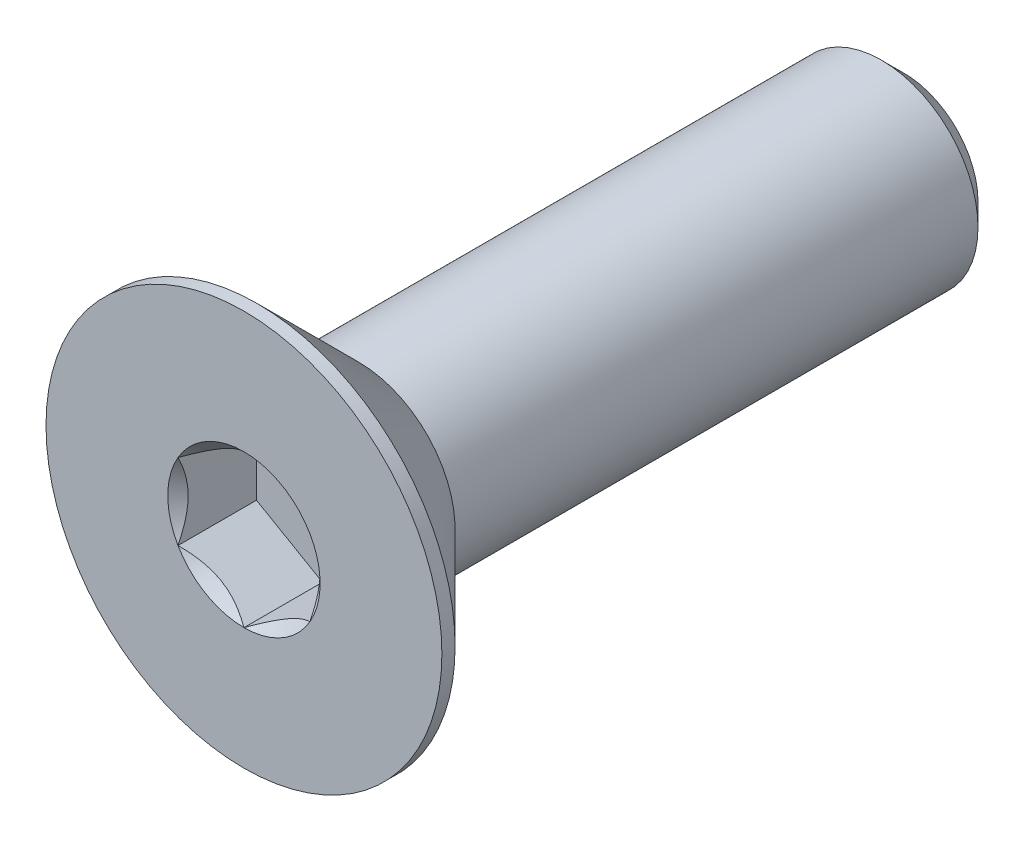
ISO-10303-21;
HEADER;
FILE_DESCRIPTION(('STEP AP214'),'2;1');
FILE_NAME('part.step','',(''),(''),'','','');
FILE_SCHEMA(('AUTOMOTIVE_DESIGN { 1 0 10303 214 1 1 1 1 }'));
ENDSEC;
DATA;
#1=APPLICATION_CONTEXT('core data for automotive mechanical design processes');
#2=APPLICATION_PROTOCOL_DEFINITION('international standard','automotive_design',2000,#1);
#3=PRODUCT_CONTEXT('',#1,'mechanical');
#4=PRODUCT('Part','Part','',(#3));
#5=PRODUCT_RELATED_PRODUCT_CATEGORY('part','',(#4));
#6=PRODUCT_DEFINITION_FORMATION('','',#4);
#7=PRODUCT_DEFINITION_CONTEXT('part definition',#1,'design');
#8=PRODUCT_DEFINITION('design','',#6,#7);
#9=PRODUCT_DEFINITION_SHAPE('','',#8);
#10=(LENGTH_UNIT() NAMED_UNIT(*) SI_UNIT(.MILLI.,.METRE.));
#11=(NAMED_UNIT(*) PLANE_ANGLE_UNIT() SI_UNIT($,.RADIAN.));
#12=(NAMED_UNIT(*) SI_UNIT($,.STERADIAN.) SOLID_ANGLE_UNIT());
#13=UNCERTAINTY_MEASURE_WITH_UNIT(LENGTH_MEASURE(1.E-05),#10,'distance_accuracy_value','');
#14=(GEOMETRIC_REPRESENTATION_CONTEXT(3) GLOBAL_UNCERTAINTY_ASSIGNED_CONTEXT((#13)) GLOBAL_UNIT_ASSIGNED_CONTEXT((#10,
#11,#12)) REPRESENTATION_CONTEXT('',''));
#15=CARTESIAN_POINT('',(0.,0.,0.));
#16=DIRECTION('',(0.,0.,1.));
#17=DIRECTION('',(1.,0.,0.));
#18=AXIS2_PLACEMENT_3D('',#15,#16,#17);
#19=CARTESIAN_POINT('',(1.,-0.577350269189626,-1.19));
#20=DIRECTION('',(0.,0.,1.));
#21=DIRECTION('',(1.,0.,0.));
#22=AXIS2_PLACEMENT_3D('',#19,#20,#21);
#23=PLANE('',#22);
#24=DIRECTION('',(0.,1.,0.));
#25=VECTOR('',#24,1.);
#26=CARTESIAN_POINT('',(-1.,0.577350269189626,-1.19));
#27=LINE('',#26,#25);
#28=CARTESIAN_POINT('',(-1.,0.577350269189627,-1.19));
#29=VERTEX_POINT('',#28);
#30=CARTESIAN_POINT('',(-1.,-0.577350269189626,-1.19));
#31=VERTEX_POINT('',#30);
#32=EDGE_CURVE('E83',#29,#31,#27,.F.);
#33=ORIENTED_EDGE('',*,*,#32,.T.);
#34=DIRECTION('',(0.866025403784439,-0.5,0.));
#35=VECTOR('',#34,1.);
#36=CARTESIAN_POINT('',(-1.,-0.577350269189626,-1.19));
#37=LINE('',#36,#35);
#38=CARTESIAN_POINT('',(0.,-1.15470053837925,-1.19));
#39=VERTEX_POINT('',#38);
#40=EDGE_CURVE('E85',#31,#39,#37,.T.);
#41=ORIENTED_EDGE('',*,*,#40,.T.);
#42=DIRECTION('',(0.866025403784439,0.5,0.));
#43=VECTOR('',#42,1.);
#44=CARTESIAN_POINT('',(0.,-1.15470053837925,-1.19));
#45=LINE('',#44,#43);
#46=CARTESIAN_POINT('',(1.,-0.577350269189626,-1.19));
#47=VERTEX_POINT('',#46);
#48=EDGE_CURVE('E86',#39,#47,#45,.T.);
#49=ORIENTED_EDGE('',*,*,#48,.T.);
#50=DIRECTION('',(0.,1.,0.));
#51=VECTOR('',#50,1.);
#52=CARTESIAN_POINT('',(1.,-0.577350269189626,-1.19));
#53=LINE('',#52,#51);
#54=CARTESIAN_POINT('',(1.,0.577350269189626,-1.19));
#55=VERTEX_POINT('',#54);
#56=EDGE_CURVE('E72',#47,#55,#53,.T.);
#57=ORIENTED_EDGE('',*,*,#56,.T.);
#58=DIRECTION('',(-0.866025403784439,0.5,0.));
#59=VECTOR('',#58,1.);
#60=CARTESIAN_POINT('',(1.,0.577350269189626,-1.19));
#61=LINE('',#60,#59);
#62=CARTESIAN_POINT('',(0.,1.15470053837925,-1.19));
#63=VERTEX_POINT('',#62);
#64=EDGE_CURVE('E111',#55,#63,#61,.T.);
#65=ORIENTED_EDGE('',*,*,#64,.T.);
#66=DIRECTION('',(-0.866025403784439,-0.5,0.));
#67=VECTOR('',#66,1.);
#68=CARTESIAN_POINT('',(0.,1.15470053837925,-1.19));
#69=LINE('',#68,#67);
#70=EDGE_CURVE('E116',#63,#29,#69,.T.);
#71=ORIENTED_EDGE('',*,*,#70,.T.);
#72=EDGE_LOOP('',(#33,#41,#49,#57,#65,#71));
#73=FACE_BOUND('',#72,.T.);
#74=ADVANCED_FACE('F17',(#73),#23,.T.);
#75=CARTESIAN_POINT('',(0.,-1.15470053837925,-1.19));
#76=DIRECTION('',(0.5,-0.866025403784439,0.));
#77=DIRECTION('',(0.866025403784439,0.5,0.));
#78=AXIS2_PLACEMENT_3D('',#75,#76,#77);
#79=PLANE('',#78);
#80=CARTESIAN_POINT('',(-2.49115863796558E-11,-1.15470053838384,-5.41781004328016E-11));
#81=CARTESIAN_POINT('',(0.0343705355318739,-1.13485670043421,-0.0198247003728132));
#82=CARTESIAN_POINT('',(0.0693156756624321,-1.11468111437554,-0.0384849664360592));
#83=CARTESIAN_POINT('',(0.140572403044767,-1.07354102364168,-0.0726511231876599));
#84=CARTESIAN_POINT('',(0.176890763115106,-1.05257260867784,-0.0881380100890203));
#85=CARTESIAN_POINT('',(0.250125097705039,-1.01029074588792,-0.114666959730657));
#86=CARTESIAN_POINT('',(0.287022429466985,-0.988988061462962,-0.12577568751602));
#87=CARTESIAN_POINT('',(0.361628600507243,-0.945914168529794,-0.142891513177912));
#88=CARTESIAN_POINT('',(0.399335163709025,-0.924144274114979,-0.14891138024967));
#89=CARTESIAN_POINT('',(0.464327716051176,-0.886620806524892,-0.154341115333756));
#90=CARTESIAN_POINT('',(0.491529304817382,-0.870915961928344,-0.155143433160573));
#91=CARTESIAN_POINT('',(0.545879708718377,-0.839536741605546,-0.153791220342047));
#92=CARTESIAN_POINT('',(0.573028510869161,-0.823862373375613,-0.151636036537232));
#93=CARTESIAN_POINT('',(0.654087027901815,-0.777063216746695,-0.14087668039145));
#94=CARTESIAN_POINT('',(0.707593237355406,-0.74617139231535,-0.127977491880707));
#95=CARTESIAN_POINT('',(0.801462739360661,-0.691975810063921,-0.0968623194753811));
#96=CARTESIAN_POINT('',(0.842267871073143,-0.668416956285401,-0.0802830123447291));
#97=CARTESIAN_POINT('',(0.922281198805544,-0.622221239980341,-0.042938715097711));
#98=CARTESIAN_POINT('',(0.961494106300555,-0.599581657282388,-0.0221873504181556));
#99=CARTESIAN_POINT('',(1.00000000002168,-0.577350269177109,-5.82450399194179E-11));
#100=B_SPLINE_CURVE_WITH_KNOTS('',3,(#80,#81,#82,#83,#84,#85,#86,#87,#88,#89,#90,#91,#92,#93,
#94,#95,#96,#97,#98,#99),.UNSPECIFIED.,.F.,.F.,(4,2,2,2,2,2,2,2,2,4),(0.,0.13318294658579,
0.267141541476444,0.398973326829551,0.53047332372228,0.624596460467739,0.718740387502035,
0.90708160060652,1.05673041333679,1.20589820629177),.UNSPECIFIED.);
#101=CARTESIAN_POINT('',(0.,-1.15470053839212,-5.7899518341867E-11));
#102=VERTEX_POINT('',#101);
#103=CARTESIAN_POINT('',(1.00000000001114,-0.577350269197114,-5.73712353374379E-11));
#104=VERTEX_POINT('',#103);
#105=EDGE_CURVE('E20',#102,#104,#100,.T.);
#106=ORIENTED_EDGE('',*,*,#105,.T.);
#107=DIRECTION('',(0.,0.,-1.));
#108=VECTOR('',#107,1.);
#109=CARTESIAN_POINT('',(1.,-0.577350269189626,-1.19));
#110=LINE('',#109,#108);
#111=EDGE_CURVE('E91',#104,#47,#110,.T.);
#112=ORIENTED_EDGE('',*,*,#111,.T.);
#113=ORIENTED_EDGE('',*,*,#48,.F.);
#114=DIRECTION('',(0.,0.,1.));
#115=VECTOR('',#114,1.);
#116=CARTESIAN_POINT('',(0.,-1.15470053837925,-1.19));
#117=LINE('',#116,#115);
#118=EDGE_CURVE('E59',#39,#102,#117,.T.);
#119=ORIENTED_EDGE('',*,*,#118,.T.);
#120=EDGE_LOOP('',(#106,#112,#113,#119));
#121=FACE_BOUND('',#120,.T.);
#122=ADVANCED_FACE('F90',(#121),#79,.F.);
#123=CARTESIAN_POINT('',(-1.,-0.577350269189626,-1.19));
#124=DIRECTION('',(-0.5,-0.866025403784439,0.));
#125=DIRECTION('',(0.866025403784439,-0.5,0.));
#126=AXIS2_PLACEMENT_3D('',#123,#124,#125);
#127=PLANE('',#126);
#128=CARTESIAN_POINT('',(-1.00000000001643,-0.577350269170344,-5.41781098430251E-11));
#129=CARTESIAN_POINT('',(-0.965629464465074,-0.597194107129382,-0.0198247003728132));
#130=CARTESIAN_POINT('',(-0.930684324336749,-0.617369693191919,-0.0384849664360593));
#131=CARTESIAN_POINT('',(-0.859427596956058,-0.658509783928631,-0.0726511231876602));
#132=CARTESIAN_POINT('',(-0.823109236885113,-0.679478198891418,-0.0881380100890208));
#133=CARTESIAN_POINT('',(-0.749874902294746,-0.721760061680587,-0.114666959730657));
#134=CARTESIAN_POINT('',(-0.712977570532958,-0.743062746105818,-0.12577568751602));
#135=CARTESIAN_POINT('',(-0.638371399492814,-0.786136639039184,-0.142891513177912));
#136=CARTESIAN_POINT('',(-0.600664836290988,-0.807906533453923,-0.14891138024967));
#137=CARTESIAN_POINT('',(-0.535672283948815,-0.845430001043971,-0.154341115333756));
#138=CARTESIAN_POINT('',(-0.508470695182615,-0.86113484564053,-0.155143433160574));
#139=CARTESIAN_POINT('',(-0.454120291281625,-0.892514065963337,-0.153791220342047));
#140=CARTESIAN_POINT('',(-0.42697148913084,-0.908188434193267,-0.151636036537233));
#141=CARTESIAN_POINT('',(-0.345912972098183,-0.95498759082218,-0.140876680391451));
#142=CARTESIAN_POINT('',(-0.292406762644593,-0.985879415253529,-0.127977491880707));
#143=CARTESIAN_POINT('',(-0.19853726063934,-1.04007499750496,-0.0968623194753812));
#144=CARTESIAN_POINT('',(-0.157732128926857,-1.06363385128348,-0.0802830123447292));
#145=CARTESIAN_POINT('',(-0.0777188011944557,-1.10982956758854,-0.0429387150977111));
#146=CARTESIAN_POINT('',(-0.0385058936994448,-1.13246915028649,-0.0221873504181558));
#147=CARTESIAN_POINT('',(2.16819179342538E-11,-1.15470053839177,-5.82453921757807E-11));
#148=B_SPLINE_CURVE_WITH_KNOTS('',3,(#128,#129,#130,#131,#132,#133,#134,#135,#136,#137,#138,
#139,#140,#141,#142,#143,#144,#145,#146,#147),.UNSPECIFIED.,.F.,.F.,(4,2,2,2,2,2,2,2,2,4),(0.,
0.133182946585791,0.267141541476445,0.398973326829552,0.530473323722281,0.62459646046774,
0.718740387502036,0.907081600606521,1.05673041333679,1.20589820629178),.UNSPECIFIED.);
#149=CARTESIAN_POINT('',(-1.00000000001114,-0.577350269196058,-5.78995478088549E-11));
#150=VERTEX_POINT('',#149);
#151=EDGE_CURVE('E95',#150,#102,#148,.T.);
#152=ORIENTED_EDGE('',*,*,#151,.T.);
#153=ORIENTED_EDGE('',*,*,#118,.F.);
#154=ORIENTED_EDGE('',*,*,#40,.F.);
#155=DIRECTION('',(0.,0.,1.));
#156=VECTOR('',#155,1.);
#157=CARTESIAN_POINT('',(-1.,-0.577350269189626,-1.19));
#158=LINE('',#157,#156);
#159=EDGE_CURVE('E97',#31,#150,#158,.T.);
#160=ORIENTED_EDGE('',*,*,#159,.T.);
#161=EDGE_LOOP('',(#152,#153,#154,#160));
#162=FACE_BOUND('',#161,.T.);
#163=ADVANCED_FACE('F93',(#162),#127,.F.);
#164=CARTESIAN_POINT('',(-1.,0.577350269189626,-1.19));
#165=DIRECTION('',(-1.,0.,0.));
#166=DIRECTION('',(0.,0.,1.));
#167=AXIS2_PLACEMENT_3D('',#164,#165,#166);
#168=PLANE('',#167);
#169=CARTESIAN_POINT('',(-0.999999999991515,0.577350269213493,-5.41783406519598E-11));
#170=CARTESIAN_POINT('',(-0.999999999996947,0.537662593304826,-0.0198247003728133));
#171=CARTESIAN_POINT('',(-0.999999999999181,0.497311421183621,-0.0384849664360593));
#172=CARTESIAN_POINT('',(-1.00000000000083,0.415031239713045,-0.0726511231876602));
#173=CARTESIAN_POINT('',(-1.00000000000022,0.373094409786423,-0.0881380100890208));
#174=CARTESIAN_POINT('',(-0.999999999999785,0.28853068420733,-0.114666959730657));
#175=CARTESIAN_POINT('',(-0.999999999999943,0.245925315357145,-0.12577568751602));
#176=CARTESIAN_POINT('',(-1.00000000000006,0.15977752949061,-0.142891513177912));
#177=CARTESIAN_POINT('',(-1.00000000000001,0.116237740661056,-0.14891138024967));
#178=CARTESIAN_POINT('',(-0.999999999999991,0.0411908054809201,-0.154341115333756));
#179=CARTESIAN_POINT('',(-0.999999999999998,0.00978111628781423,-0.155143433160573));
#180=CARTESIAN_POINT('',(-1.,-0.0529773243577915,-0.153791220342047));
#181=CARTESIAN_POINT('',(-1.,-0.0843260608176537,-0.151636036537233));
#182=CARTESIAN_POINT('',(-0.999999999999999,-0.177924374075485,-0.140876680391451));
#183=CARTESIAN_POINT('',(-1.,-0.239708022938179,-0.127977491880707));
#184=CARTESIAN_POINT('',(-1.,-0.348099187441038,-0.0968623194753813));
#185=CARTESIAN_POINT('',(-1.,-0.395216894998078,-0.0802830123447294));
#186=CARTESIAN_POINT('',(-1.,-0.487608327608197,-0.0429387150977113));
#187=CARTESIAN_POINT('',(-1.,-0.532887493004102,-0.0221873504181559));
#188=CARTESIAN_POINT('',(-1.,-0.577350269214662,-5.82453089025445E-11));
#189=B_SPLINE_CURVE_WITH_KNOTS('',3,(#169,#170,#171,#172,#173,#174,#175,#176,#177,#178,#179,
#180,#181,#182,#183,#184,#185,#186,#187,#188),.UNSPECIFIED.,.F.,.F.,(4,2,2,2,2,2,2,2,2,4),(0.,
0.133182946585791,0.267141541476445,0.398973326829551,0.53047332372228,0.624596460467739,
0.718740387502035,0.907081600606521,1.05673041333679,1.20589820629177),.UNSPECIFIED.);
#190=CARTESIAN_POINT('',(-1.00000000001114,0.577350269196058,-5.78993939352179E-11));
#191=VERTEX_POINT('',#190);
#192=EDGE_CURVE('E195',#191,#150,#189,.T.);
#193=ORIENTED_EDGE('',*,*,#192,.T.);
#194=ORIENTED_EDGE('',*,*,#159,.F.);
#195=ORIENTED_EDGE('',*,*,#32,.F.);
#196=DIRECTION('',(0.,0.,1.));
#197=VECTOR('',#196,1.);
#198=CARTESIAN_POINT('',(-1.,0.577350269189626,-1.19));
#199=LINE('',#198,#197);
#200=EDGE_CURVE('E113',#29,#191,#199,.T.);
#201=ORIENTED_EDGE('',*,*,#200,.T.);
#202=EDGE_LOOP('',(#193,#194,#195,#201));
#203=FACE_BOUND('',#202,.T.);
#204=ADVANCED_FACE('F205',(#203),#168,.F.);
#205=CARTESIAN_POINT('',(0.,1.15470053837925,-1.19));
#206=DIRECTION('',(-0.5,0.866025403784439,0.));
#207=DIRECTION('',(-0.866025403784439,-0.5,0.));
#208=AXIS2_PLACEMENT_3D('',#205,#206,#207);
#209=PLANE('',#208);
#210=CARTESIAN_POINT('',(2.49118370663293E-11,1.15470053838384,-5.41779513836449E-11));
#211=CARTESIAN_POINT('',(-0.0343705355318736,1.13485670043421,-0.0198247003728131));
#212=CARTESIAN_POINT('',(-0.0693156756624319,1.11468111437554,-0.038484966436059));
#213=CARTESIAN_POINT('',(-0.140572403044767,1.07354102364168,-0.0726511231876599));
#214=CARTESIAN_POINT('',(-0.176890763115106,1.05257260867784,-0.0881380100890203));
#215=CARTESIAN_POINT('',(-0.250125097705039,1.01029074588792,-0.114666959730657));
#216=CARTESIAN_POINT('',(-0.287022429466985,0.988988061462962,-0.12577568751602));
#217=CARTESIAN_POINT('',(-0.361628600507243,0.945914168529794,-0.142891513177912));
#218=CARTESIAN_POINT('',(-0.399335163709025,0.924144274114979,-0.14891138024967));
#219=CARTESIAN_POINT('',(-0.464327716051176,0.886620806524892,-0.154341115333756));
#220=CARTESIAN_POINT('',(-0.491529304817382,0.870915961928344,-0.155143433160573));
#221=CARTESIAN_POINT('',(-0.545879708718377,0.839536741605546,-0.153791220342047));
#222=CARTESIAN_POINT('',(-0.573028510869161,0.823862373375613,-0.151636036537232));
#223=CARTESIAN_POINT('',(-0.654087027901815,0.777063216746695,-0.14087668039145));
#224=CARTESIAN_POINT('',(-0.707593237355407,0.746171392315349,-0.127977491880707));
#225=CARTESIAN_POINT('',(-0.801462739360661,0.691975810063921,-0.0968623194753808));
#226=CARTESIAN_POINT('',(-0.842267871073143,0.668416956285401,-0.0802830123447289));
#227=CARTESIAN_POINT('',(-0.922281198805544,0.622221239980341,-0.0429387150977108));
#228=CARTESIAN_POINT('',(-0.961494106300555,0.599581657282388,-0.0221873504181555));
#229=CARTESIAN_POINT('',(-1.00000000002168,0.577350269177109,-5.82451634141655E-11));
#230=B_SPLINE_CURVE_WITH_KNOTS('',3,(#210,#211,#212,#213,#214,#215,#216,#217,#218,#219,#220,
#221,#222,#223,#224,#225,#226,#227,#228,#229),.UNSPECIFIED.,.F.,.F.,(4,2,2,2,2,2,2,2,2,4),(0.,
0.13318294658579,0.267141541476445,0.398973326829551,0.53047332372228,0.624596460467739,
0.718740387502035,0.907081600606521,1.05673041333679,1.20589820629177),.UNSPECIFIED.);
#231=CARTESIAN_POINT('',(0.,1.15470053839212,-5.78994737097209E-11));
#232=VERTEX_POINT('',#231);
#233=EDGE_CURVE('E187',#232,#191,#230,.T.);
#234=ORIENTED_EDGE('',*,*,#233,.T.);
#235=ORIENTED_EDGE('',*,*,#200,.F.);
#236=ORIENTED_EDGE('',*,*,#70,.F.);
#237=DIRECTION('',(0.,0.,1.));
#238=VECTOR('',#237,1.);
#239=CARTESIAN_POINT('',(0.,1.15470053837925,-1.19));
#240=LINE('',#239,#238);
#241=EDGE_CURVE('E108',#63,#232,#240,.T.);
#242=ORIENTED_EDGE('',*,*,#241,.T.);
#243=EDGE_LOOP('',(#234,#235,#236,#242));
#244=FACE_BOUND('',#243,.T.);
#245=ADVANCED_FACE('F201',(#244),#209,.F.);
#246=CARTESIAN_POINT('',(1.,0.577350269189626,-1.19));
#247=DIRECTION('',(0.5,0.866025403784439,0.));
#248=DIRECTION('',(-0.866025403784439,0.5,0.));
#249=AXIS2_PLACEMENT_3D('',#246,#247,#248);
#250=PLANE('',#249);
#251=CARTESIAN_POINT('',(1.00000000001643,0.577350269170344,-5.41782192870622E-11));
#252=CARTESIAN_POINT('',(0.965629464465074,0.597194107129382,-0.0198247003728134));
#253=CARTESIAN_POINT('',(0.930684324336749,0.617369693191919,-0.0384849664360593));
#254=CARTESIAN_POINT('',(0.859427596956059,0.658509783928631,-0.0726511231876602));
#255=CARTESIAN_POINT('',(0.823109236885114,0.679478198891417,-0.0881380100890206));
#256=CARTESIAN_POINT('',(0.749874902294746,0.721760061680587,-0.114666959730657));
#257=CARTESIAN_POINT('',(0.712977570532958,0.743062746105817,-0.12577568751602));
#258=CARTESIAN_POINT('',(0.638371399492814,0.786136639039184,-0.142891513177912));
#259=CARTESIAN_POINT('',(0.600664836290989,0.807906533453922,-0.14891138024967));
#260=CARTESIAN_POINT('',(0.535672283948816,0.845430001043971,-0.154341115333756));
#261=CARTESIAN_POINT('',(0.508470695182616,0.86113484564053,-0.155143433160573));
#262=CARTESIAN_POINT('',(0.454120291281626,0.892514065963337,-0.153791220342047));
#263=CARTESIAN_POINT('',(0.426971489130841,0.908188434193267,-0.151636036537233));
#264=CARTESIAN_POINT('',(0.345912972098184,0.95498759082218,-0.140876680391451));
#265=CARTESIAN_POINT('',(0.292406762644594,0.985879415253528,-0.127977491880708));
#266=CARTESIAN_POINT('',(0.198537260639341,1.04007499750496,-0.0968623194753815));
#267=CARTESIAN_POINT('',(0.157732128926858,1.06363385128348,-0.0802830123447295));
#268=CARTESIAN_POINT('',(0.0777188011944567,1.10982956758854,-0.0429387150977113));
#269=CARTESIAN_POINT('',(0.0385058936994457,1.13246915028649,-0.0221873504181559));
#270=CARTESIAN_POINT('',(-2.16813571472064E-11,1.15470053839177,-5.82454903182959E-11));
#271=B_SPLINE_CURVE_WITH_KNOTS('',3,(#251,#252,#253,#254,#255,#256,#257,#258,#259,#260,#261,
#262,#263,#264,#265,#266,#267,#268,#269,#270),.UNSPECIFIED.,.F.,.F.,(4,2,2,2,2,2,2,2,2,4),(0.,
0.13318294658579,0.267141541476445,0.398973326829551,0.53047332372228,0.624596460467739,
0.718740387502035,0.90708160060652,1.05673041333679,1.20589820629177),.UNSPECIFIED.);
#272=CARTESIAN_POINT('',(1.00000000001114,0.577350269196058,-5.78995353441607E-11));
#273=VERTEX_POINT('',#272);
#274=EDGE_CURVE('E157',#273,#232,#271,.T.);
#275=ORIENTED_EDGE('',*,*,#274,.T.);
#276=ORIENTED_EDGE('',*,*,#241,.F.);
#277=ORIENTED_EDGE('',*,*,#64,.F.);
#278=DIRECTION('',(0.,0.,-1.));
#279=VECTOR('',#278,1.);
#280=CARTESIAN_POINT('',(1.,0.577350269189626,-1.19));
#281=LINE('',#280,#279);
#282=EDGE_CURVE('E40',#55,#273,#281,.F.);
#283=ORIENTED_EDGE('',*,*,#282,.T.);
#284=EDGE_LOOP('',(#275,#276,#277,#283));
#285=FACE_BOUND('',#284,.T.);
#286=ADVANCED_FACE('F204',(#285),#250,.F.);
#287=CARTESIAN_POINT('',(1.,-0.577350269189626,-1.19));
#288=DIRECTION('',(1.,0.,0.));
#289=DIRECTION('',(0.,0.,-1.));
#290=AXIS2_PLACEMENT_3D('',#287,#288,#289);
#291=PLANE('',#290);
#292=CARTESIAN_POINT('',(0.999999999991515,-0.577350269213493,-5.41782112153335E-11));
#293=CARTESIAN_POINT('',(0.999999999996947,-0.537662593304826,-0.0198247003728133));
#294=CARTESIAN_POINT('',(0.999999999999181,-0.497311421183621,-0.0384849664360593));
#295=CARTESIAN_POINT('',(1.00000000000083,-0.415031239713045,-0.0726511231876602));
#296=CARTESIAN_POINT('',(1.00000000000022,-0.373094409786423,-0.0881380100890208));
#297=CARTESIAN_POINT('',(0.999999999999785,-0.28853068420733,-0.114666959730657));
#298=CARTESIAN_POINT('',(0.999999999999943,-0.245925315357145,-0.12577568751602));
#299=CARTESIAN_POINT('',(1.00000000000006,-0.15977752949061,-0.142891513177912));
#300=CARTESIAN_POINT('',(1.00000000000001,-0.116237740661056,-0.14891138024967));
#301=CARTESIAN_POINT('',(0.999999999999991,-0.0411908054809201,-0.154341115333756));
#302=CARTESIAN_POINT('',(0.999999999999998,-0.00978111628781425,-0.155143433160573));
#303=CARTESIAN_POINT('',(1.,0.0529773243577915,-0.153791220342047));
#304=CARTESIAN_POINT('',(1.,0.0843260608176536,-0.151636036537233));
#305=CARTESIAN_POINT('',(0.999999999999999,0.177924374075485,-0.140876680391451));
#306=CARTESIAN_POINT('',(1.,0.239708022938179,-0.127977491880707));
#307=CARTESIAN_POINT('',(1.,0.348099187441038,-0.0968623194753813));
#308=CARTESIAN_POINT('',(1.,0.395216894998078,-0.0802830123447294));
#309=CARTESIAN_POINT('',(1.,0.487608327608197,-0.0429387150977113));
#310=CARTESIAN_POINT('',(1.,0.532887493004102,-0.0221873504181559));
#311=CARTESIAN_POINT('',(1.,0.577350269214662,-5.82453089025445E-11));
#312=B_SPLINE_CURVE_WITH_KNOTS('',3,(#292,#293,#294,#295,#296,#297,#298,#299,#300,#301,#302,
#303,#304,#305,#306,#307,#308,#309,#310,#311),.UNSPECIFIED.,.F.,.F.,(4,2,2,2,2,2,2,2,2,4),(0.,
0.133182946585791,0.267141541476445,0.398973326829551,0.53047332372228,0.624596460467739,
0.718740387502035,0.907081600606521,1.05673041333679,1.20589820629177),.UNSPECIFIED.);
#313=EDGE_CURVE('E149',#104,#273,#312,.T.);
#314=ORIENTED_EDGE('',*,*,#313,.T.);
#315=ORIENTED_EDGE('',*,*,#282,.F.);
#316=ORIENTED_EDGE('',*,*,#56,.F.);
#317=ORIENTED_EDGE('',*,*,#111,.F.);
#318=EDGE_LOOP('',(#314,#315,#316,#317));
#319=FACE_BOUND('',#318,.T.);
#320=ADVANCED_FACE('F165',(#319),#291,.F.);
#321=CARTESIAN_POINT('',(0.,0.,-1.13686837721616E-10));
#322=DIRECTION('',(0.,0.,1.));
#323=DIRECTION('',(1.,0.,0.));
#324=AXIS2_PLACEMENT_3D('',#321,#322,#323);
#325=CONICAL_SURFACE('',#324,1.15470053833633,0.785398163397448);
#326=ORIENTED_EDGE('',*,*,#105,.F.);
#327=CARTESIAN_POINT('',(0.,0.,-5.6843418860808E-11));
#328=DIRECTION('',(0.,0.,1.));
#329=DIRECTION('',(1.,0.,0.));
#330=AXIS2_PLACEMENT_3D('',#327,#328,#329);
#331=CIRCLE('',#330,1.15470053839317);
#332=EDGE_CURVE('E146',#104,#102,#331,.F.);
#333=ORIENTED_EDGE('',*,*,#332,.F.);
#334=EDGE_LOOP('',(#326,#333));
#335=FACE_BOUND('',#334,.T.);
#336=ADVANCED_FACE('F222',(#335),#325,.F.);
#337=CARTESIAN_POINT('',(0.,0.,-1.13686837721616E-10));
#338=DIRECTION('',(0.,0.,1.));
#339=DIRECTION('',(1.,0.,0.));
#340=AXIS2_PLACEMENT_3D('',#337,#338,#339);
#341=CONICAL_SURFACE('',#340,1.15470053833633,0.785398163397448);
#342=ORIENTED_EDGE('',*,*,#151,.F.);
#343=CARTESIAN_POINT('',(0.,0.,-5.6843418860808E-11));
#344=DIRECTION('',(0.,0.,1.));
#345=DIRECTION('',(1.,0.,0.));
#346=AXIS2_PLACEMENT_3D('',#343,#344,#345);
#347=CIRCLE('',#346,1.15470053839317);
#348=EDGE_CURVE('E143',#102,#150,#347,.F.);
#349=ORIENTED_EDGE('',*,*,#348,.F.);
#350=EDGE_LOOP('',(#342,#349));
#351=FACE_BOUND('',#350,.T.);
#352=ADVANCED_FACE('F219',(#351),#341,.F.);
#353=CARTESIAN_POINT('',(0.,0.,-1.13686837721616E-10));
#354=DIRECTION('',(0.,0.,1.));
#355=DIRECTION('',(1.,0.,0.));
#356=AXIS2_PLACEMENT_3D('',#353,#354,#355);
#357=CONICAL_SURFACE('',#356,1.15470053833633,0.785398163397448);
#358=ORIENTED_EDGE('',*,*,#192,.F.);
#359=CARTESIAN_POINT('',(0.,0.,-5.6843418860808E-11));
#360=DIRECTION('',(0.,0.,1.));
#361=DIRECTION('',(1.,0.,0.));
#362=AXIS2_PLACEMENT_3D('',#359,#360,#361);
#363=CIRCLE('',#362,1.15470053839317);
#364=EDGE_CURVE('E140',#150,#191,#363,.F.);
#365=ORIENTED_EDGE('',*,*,#364,.F.);
#366=EDGE_LOOP('',(#358,#365));
#367=FACE_BOUND('',#366,.T.);
#368=ADVANCED_FACE('F183',(#367),#357,.F.);
#369=CARTESIAN_POINT('',(0.,0.,-1.13686837721616E-10));
#370=DIRECTION('',(0.,0.,1.));
#371=DIRECTION('',(1.,0.,0.));
#372=AXIS2_PLACEMENT_3D('',#369,#370,#371);
#373=CONICAL_SURFACE('',#372,1.15470053833633,0.785398163397448);
#374=ORIENTED_EDGE('',*,*,#233,.F.);
#375=CARTESIAN_POINT('',(0.,0.,-5.6843418860808E-11));
#376=DIRECTION('',(0.,0.,1.));
#377=DIRECTION('',(1.,0.,0.));
#378=AXIS2_PLACEMENT_3D('',#375,#376,#377);
#379=CIRCLE('',#378,1.15470053839317);
#380=EDGE_CURVE('E137',#191,#232,#379,.F.);
#381=ORIENTED_EDGE('',*,*,#380,.F.);
#382=EDGE_LOOP('',(#374,#381));
#383=FACE_BOUND('',#382,.T.);
#384=ADVANCED_FACE('F178',(#383),#373,.F.);
#385=CARTESIAN_POINT('',(0.,0.,-1.13686837721616E-10));
#386=DIRECTION('',(0.,0.,1.));
#387=DIRECTION('',(1.,0.,0.));
#388=AXIS2_PLACEMENT_3D('',#385,#386,#387);
#389=CONICAL_SURFACE('',#388,1.15470053833633,0.785398163397448);
#390=ORIENTED_EDGE('',*,*,#274,.F.);
#391=CARTESIAN_POINT('',(0.,0.,-5.6843418860808E-11));
#392=DIRECTION('',(0.,0.,1.));
#393=DIRECTION('',(1.,0.,0.));
#394=AXIS2_PLACEMENT_3D('',#391,#392,#393);
#395=CIRCLE('',#394,1.15470053839317);
#396=EDGE_CURVE('E134',#232,#273,#395,.F.);
#397=ORIENTED_EDGE('',*,*,#396,.F.);
#398=EDGE_LOOP('',(#390,#397));
#399=FACE_BOUND('',#398,.T.);
#400=ADVANCED_FACE('F172',(#399),#389,.F.);
#401=CARTESIAN_POINT('',(0.,0.,-1.13686837721616E-10));
#402=DIRECTION('',(0.,0.,1.));
#403=DIRECTION('',(1.,0.,0.));
#404=AXIS2_PLACEMENT_3D('',#401,#402,#403);
#405=CONICAL_SURFACE('',#404,1.15470053833633,0.785398163397448);
#406=CARTESIAN_POINT('',(0.,0.,-5.6843418860808E-11));
#407=DIRECTION('',(0.,0.,1.));
#408=DIRECTION('',(1.,0.,0.));
#409=AXIS2_PLACEMENT_3D('',#406,#407,#408);
#410=CIRCLE('',#409,1.15470053839317);
#411=EDGE_CURVE('E131',#273,#104,#410,.F.);
#412=ORIENTED_EDGE('',*,*,#411,.F.);
#413=ORIENTED_EDGE('',*,*,#313,.F.);
#414=EDGE_LOOP('',(#412,#413));
#415=FACE_BOUND('',#414,.T.);
#416=ADVANCED_FACE('F167',(#415),#405,.F.);
#417=CARTESIAN_POINT('',(0.,-1.5,0.));
#418=DIRECTION('',(0.,0.,1.));
#419=DIRECTION('',(0.,-1.,0.));
#420=AXIS2_PLACEMENT_3D('',#417,#418,#419);
#421=PLANE('',#420);
#422=ORIENTED_EDGE('',*,*,#396,.T.);
#423=ORIENTED_EDGE('',*,*,#411,.T.);
#424=ORIENTED_EDGE('',*,*,#332,.T.);
#425=ORIENTED_EDGE('',*,*,#348,.T.);
#426=ORIENTED_EDGE('',*,*,#364,.T.);
#427=ORIENTED_EDGE('',*,*,#380,.T.);
#428=EDGE_LOOP('',(#422,#423,#424,#425,#426,#427));
#429=FACE_BOUND('',#428,.T.);
#430=CARTESIAN_POINT('',(0.,0.,0.));
#431=DIRECTION('',(0.,0.,1.));
#432=DIRECTION('',(0.,-1.,0.));
#433=AXIS2_PLACEMENT_3D('',#430,#431,#432);
#434=CIRCLE('',#433,2.99999999999999);
#435=CARTESIAN_POINT('',(0.,-2.99999999999999,0.));
#436=VERTEX_POINT('',#435);
#437=EDGE_CURVE('E128',#436,#436,#434,.F.);
#438=ORIENTED_EDGE('',*,*,#437,.F.);
#439=EDGE_LOOP('',(#438));
#440=FACE_BOUND('',#439,.T.);
#441=ADVANCED_FACE('F171',(#429,#440),#421,.T.);
#442=CARTESIAN_POINT('',(0.,-1.5,-10.));
#443=DIRECTION('',(0.,0.,-1.));
#444=DIRECTION('',(0.,1.,0.));
#445=AXIS2_PLACEMENT_3D('',#442,#443,#444);
#446=PLANE('',#445);
#447=CARTESIAN_POINT('',(0.,0.,-9.99999999999091));
#448=DIRECTION('',(0.,0.,1.));
#449=DIRECTION('',(1.,0.,0.));
#450=AXIS2_PLACEMENT_3D('',#447,#448,#449);
#451=CIRCLE('',#450,1.12500000000182);
#452=CARTESIAN_POINT('',(1.12500000000182,0.,-9.99999999999091));
#453=VERTEX_POINT('',#452);
#454=EDGE_CURVE('E124',#453,#453,#451,.T.);
#455=ORIENTED_EDGE('',*,*,#454,.F.);
#456=EDGE_LOOP('',(#455));
#457=FACE_BOUND('',#456,.T.);
#458=ADVANCED_FACE('F250',(#457),#446,.T.);
#459=CARTESIAN_POINT('',(0.,0.,0.));
#460=DIRECTION('',(0.,0.,1.));
#461=DIRECTION('',(0.,-1.,0.));
#462=AXIS2_PLACEMENT_3D('',#459,#460,#461);
#463=CYLINDRICAL_SURFACE('',#462,2.99999999999999);
#464=CARTESIAN_POINT('',(0.,0.,-0.200000000063485));
#465=DIRECTION('',(0.,0.,1.));
#466=DIRECTION('',(0.,-1.,0.));
#467=AXIS2_PLACEMENT_3D('',#464,#465,#466);
#468=CIRCLE('',#467,3.00000000009959);
#469=CARTESIAN_POINT('',(0.,-3.00000000009959,-0.200000000063483));
#470=VERTEX_POINT('',#469);
#471=EDGE_CURVE('E127',#470,#470,#468,.F.);
#472=ORIENTED_EDGE('',*,*,#471,.F.);
#473=EDGE_LOOP('',(#472));
#474=FACE_BOUND('',#473,.T.);
#475=ORIENTED_EDGE('',*,*,#437,.T.);
#476=EDGE_LOOP('',(#475));
#477=FACE_BOUND('',#476,.T.);
#478=ADVANCED_FACE('F247',(#474,#477),#463,.T.);
#479=CARTESIAN_POINT('',(0.,0.,-9.66150000010657));
#480=DIRECTION('',(0.,0.,1.));
#481=DIRECTION('',(1.,0.,0.));
#482=AXIS2_PLACEMENT_3D('',#479,#480,#481);
#483=CONICAL_SURFACE('',#482,1.46349999988615,0.785398163397448);
#484=CARTESIAN_POINT('',(0.,0.,-9.66149999999999));
#485=DIRECTION('',(0.,0.,-1.));
#486=DIRECTION('',(0.,1.,0.));
#487=AXIS2_PLACEMENT_3D('',#484,#485,#486);
#488=CIRCLE('',#487,1.4635);
#489=CARTESIAN_POINT('',(0.,1.4635,-9.66149999999999));
#490=VERTEX_POINT('',#489);
#491=EDGE_CURVE('E31',#490,#490,#488,.F.);
#492=ORIENTED_EDGE('',*,*,#491,.F.);
#493=EDGE_LOOP('',(#492));
#494=FACE_BOUND('',#493,.T.);
#495=ORIENTED_EDGE('',*,*,#454,.T.);
#496=EDGE_LOOP('',(#495));
#497=FACE_BOUND('',#496,.T.);
#498=ADVANCED_FACE('F240',(#494,#497),#483,.T.);
#499=CARTESIAN_POINT('',(0.,0.,-0.200000000120328));
#500=DIRECTION('',(0.,0.,1.));
#501=DIRECTION('',(0.,-1.,0.));
#502=AXIS2_PLACEMENT_3D('',#499,#500,#501);
#503=CONICAL_SURFACE('',#502,2.9999999999859,0.785398163378951);
#504=CARTESIAN_POINT('',(0.,0.,-1.7365));
#505=DIRECTION('',(0.,0.,-1.));
#506=DIRECTION('',(0.,1.,0.));
#507=AXIS2_PLACEMENT_3D('',#504,#505,#506);
#508=CIRCLE('',#507,1.4635);
#509=CARTESIAN_POINT('',(0.,1.4635,-1.7365));
#510=VERTEX_POINT('',#509);
#511=EDGE_CURVE('E11',#510,#510,#508,.T.);
#512=ORIENTED_EDGE('',*,*,#511,.F.);
#513=EDGE_LOOP('',(#512));
#514=FACE_BOUND('',#513,.T.);
#515=ORIENTED_EDGE('',*,*,#471,.T.);
#516=EDGE_LOOP('',(#515));
#517=FACE_BOUND('',#516,.T.);
#518=ADVANCED_FACE('F234',(#514,#517),#503,.T.);
#519=CARTESIAN_POINT('',(0.,0.,-10.));
#520=DIRECTION('',(0.,0.,-1.));
#521=DIRECTION('',(0.,1.,0.));
#522=AXIS2_PLACEMENT_3D('',#519,#520,#521);
#523=CYLINDRICAL_SURFACE('',#522,1.4635);
#524=ORIENTED_EDGE('',*,*,#511,.T.);
#525=EDGE_LOOP('',(#524));
#526=FACE_BOUND('',#525,.T.);
#527=ORIENTED_EDGE('',*,*,#491,.T.);
#528=EDGE_LOOP('',(#527));
#529=FACE_BOUND('',#528,.T.);
#530=ADVANCED_FACE('F232',(#526,#529),#523,.T.);
#531=CLOSED_SHELL('',(#74,#122,#163,#204,#245,#286,#320,#336,#352,#368,#384,#400,#416,#441,#458,
#478,#498,#518,#530));
#532=MANIFOLD_SOLID_BREP('B1',#531);
#533=ADVANCED_BREP_SHAPE_REPRESENTATION('',(#18,#532),#14);
#534=SHAPE_DEFINITION_REPRESENTATION(#9,#533);
ENDSEC;
END-ISO-10303-21;
